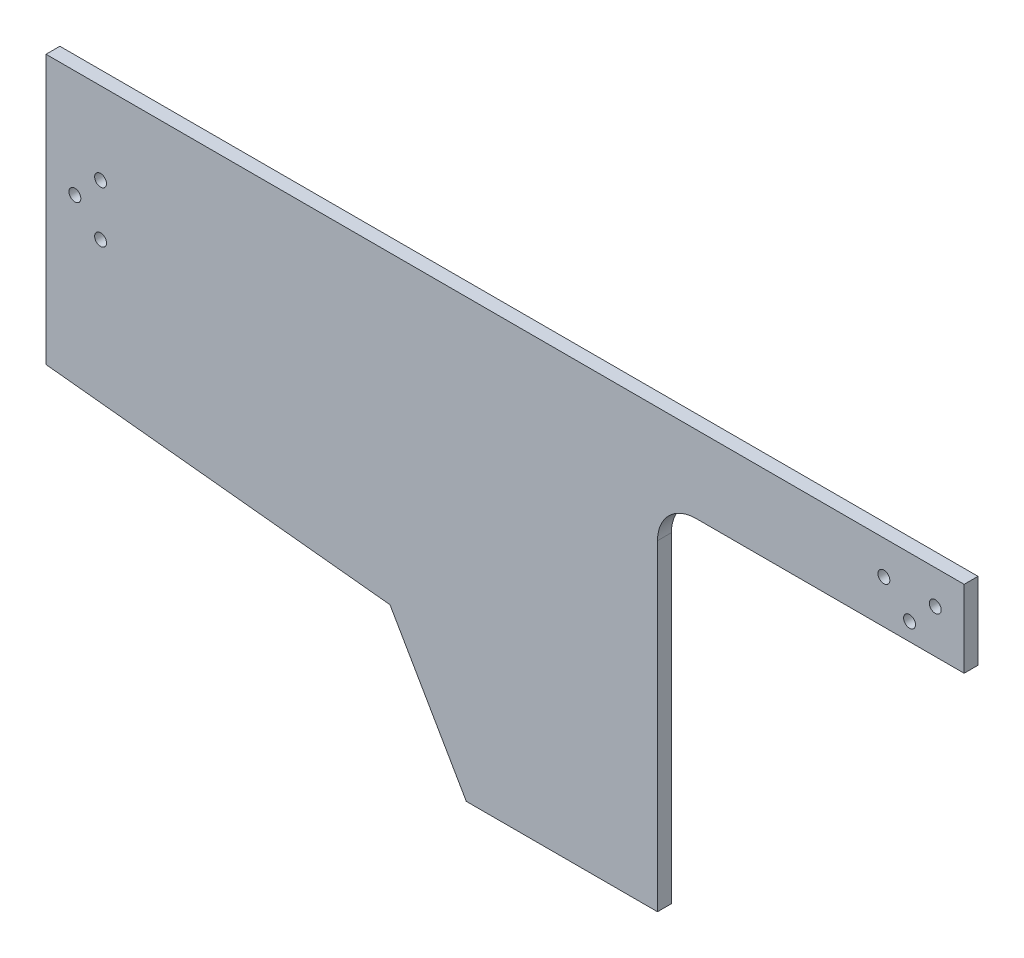
ISO-10303-21;
HEADER;
FILE_DESCRIPTION(('STEP AP214'),'2;1');
FILE_NAME('part.step','',(''),(''),'','','');
FILE_SCHEMA(('AUTOMOTIVE_DESIGN { 1 0 10303 214 1 1 1 1 }'));
ENDSEC;
DATA;
#1=APPLICATION_CONTEXT('core data for automotive mechanical design processes');
#2=APPLICATION_PROTOCOL_DEFINITION('international standard','automotive_design',2000,#1);
#3=PRODUCT_CONTEXT('',#1,'mechanical');
#4=PRODUCT('Part','Part','',(#3));
#5=PRODUCT_RELATED_PRODUCT_CATEGORY('part','',(#4));
#6=PRODUCT_DEFINITION_FORMATION('','',#4);
#7=PRODUCT_DEFINITION_CONTEXT('part definition',#1,'design');
#8=PRODUCT_DEFINITION('design','',#6,#7);
#9=PRODUCT_DEFINITION_SHAPE('','',#8);
#10=(LENGTH_UNIT() NAMED_UNIT(*) SI_UNIT(.MILLI.,.METRE.));
#11=(NAMED_UNIT(*) PLANE_ANGLE_UNIT() SI_UNIT($,.RADIAN.));
#12=(NAMED_UNIT(*) SI_UNIT($,.STERADIAN.) SOLID_ANGLE_UNIT());
#13=UNCERTAINTY_MEASURE_WITH_UNIT(LENGTH_MEASURE(1.E-05),#10,'distance_accuracy_value','');
#14=(GEOMETRIC_REPRESENTATION_CONTEXT(3) GLOBAL_UNCERTAINTY_ASSIGNED_CONTEXT((#13)) GLOBAL_UNIT_ASSIGNED_CONTEXT((#10,
#11,#12)) REPRESENTATION_CONTEXT('',''));
#15=CARTESIAN_POINT('',(0.,0.,0.));
#16=DIRECTION('',(0.,0.,1.));
#17=DIRECTION('',(1.,0.,0.));
#18=AXIS2_PLACEMENT_3D('',#15,#16,#17);
#19=CARTESIAN_POINT('',(59.48,175.,4.318));
#20=DIRECTION('',(0.,0.,-1.));
#21=DIRECTION('',(-1.,0.,0.));
#22=AXIS2_PLACEMENT_3D('',#19,#20,#21);
#23=PLANE('',#22);
#24=CARTESIAN_POINT('',(59.48,175.,4.318));
#25=DIRECTION('',(0.,0.,-1.));
#26=DIRECTION('',(-1.,0.,0.));
#27=AXIS2_PLACEMENT_3D('',#24,#25,#26);
#28=CIRCLE('',#27,12.);
#29=CARTESIAN_POINT('',(47.48,175.,4.318));
#30=VERTEX_POINT('',#29);
#31=CARTESIAN_POINT('',(59.4800000000001,187.,4.318));
#32=VERTEX_POINT('',#31);
#33=EDGE_CURVE('E153',#30,#32,#28,.T.);
#34=ORIENTED_EDGE('',*,*,#33,.T.);
#35=DIRECTION('',(1.,0.,0.));
#36=VECTOR('',#35,1.);
#37=CARTESIAN_POINT('',(59.4800000000001,187.,4.318));
#38=LINE('',#37,#36);
#39=CARTESIAN_POINT('',(143.,187.,4.318));
#40=VERTEX_POINT('',#39);
#41=EDGE_CURVE('E96',#32,#40,#38,.T.);
#42=ORIENTED_EDGE('',*,*,#41,.T.);
#43=DIRECTION('',(0.,1.,0.));
#44=VECTOR('',#43,1.);
#45=CARTESIAN_POINT('',(143.,187.,4.318));
#46=LINE('',#45,#44);
#47=CARTESIAN_POINT('',(143.,211.,4.318));
#48=VERTEX_POINT('',#47);
#49=EDGE_CURVE('E171',#40,#48,#46,.T.);
#50=ORIENTED_EDGE('',*,*,#49,.T.);
#51=DIRECTION('',(-1.,0.,0.));
#52=VECTOR('',#51,1.);
#53=CARTESIAN_POINT('',(143.,211.,4.318));
#54=LINE('',#53,#52);
#55=CARTESIAN_POINT('',(-143.,211.,4.318));
#56=VERTEX_POINT('',#55);
#57=EDGE_CURVE('E188',#48,#56,#54,.T.);
#58=ORIENTED_EDGE('',*,*,#57,.T.);
#59=DIRECTION('',(0.,-1.,0.));
#60=VECTOR('',#59,1.);
#61=CARTESIAN_POINT('',(-143.,127.288973425982,4.318));
#62=LINE('',#61,#60);
#63=CARTESIAN_POINT('',(-143.,127.288973425982,4.318));
#64=VERTEX_POINT('',#63);
#65=EDGE_CURVE('E187',#56,#64,#62,.T.);
#66=ORIENTED_EDGE('',*,*,#65,.T.);
#67=DIRECTION('',(0.994559855190001,-0.104166666666667,0.));
#68=VECTOR('',#67,1.);
#69=CARTESIAN_POINT('',(-35.8424512344837,116.06567237997,4.318));
#70=LINE('',#69,#68);
#71=CARTESIAN_POINT('',(-35.8424512344837,116.06567237997,4.318));
#72=VERTEX_POINT('',#71);
#73=EDGE_CURVE('E118',#64,#72,#70,.T.);
#74=ORIENTED_EDGE('',*,*,#73,.T.);
#75=DIRECTION('',(0.500000000000004,-0.866025403784436,0.));
#76=VECTOR('',#75,1.);
#77=CARTESIAN_POINT('',(-12.0774460348389,74.9034759320476,4.318));
#78=LINE('',#77,#76);
#79=CARTESIAN_POINT('',(-12.0774460348389,74.9034759320476,4.318));
#80=VERTEX_POINT('',#79);
#81=EDGE_CURVE('E112',#72,#80,#78,.T.);
#82=ORIENTED_EDGE('',*,*,#81,.T.);
#83=DIRECTION('',(1.,0.,0.));
#84=VECTOR('',#83,1.);
#85=CARTESIAN_POINT('',(-12.0774460348389,74.9034759320476,4.318));
#86=LINE('',#85,#84);
#87=CARTESIAN_POINT('',(47.48,74.9034759320476,4.318));
#88=VERTEX_POINT('',#87);
#89=EDGE_CURVE('E116',#80,#88,#86,.T.);
#90=ORIENTED_EDGE('',*,*,#89,.T.);
#91=DIRECTION('',(0.,1.,0.));
#92=VECTOR('',#91,1.);
#93=CARTESIAN_POINT('',(47.48,175.,4.318));
#94=LINE('',#93,#92);
#95=EDGE_CURVE('E50',#88,#30,#94,.T.);
#96=ORIENTED_EDGE('',*,*,#95,.T.);
#97=EDGE_LOOP('',(#34,#42,#50,#58,#66,#74,#82,#90,#96));
#98=FACE_BOUND('',#97,.T.);
#99=CARTESIAN_POINT('',(-134.,177.5,4.318));
#100=DIRECTION('',(0.,0.,1.));
#101=DIRECTION('',(1.,0.,0.));
#102=AXIS2_PLACEMENT_3D('',#99,#100,#101);
#103=CIRCLE('',#102,1.84999999999999);
#104=CARTESIAN_POINT('',(-132.15,177.5,4.318));
#105=VERTEX_POINT('',#104);
#106=EDGE_CURVE('E140',#105,#105,#103,.T.);
#107=ORIENTED_EDGE('',*,*,#106,.F.);
#108=EDGE_LOOP('',(#107));
#109=FACE_BOUND('',#108,.T.);
#110=CARTESIAN_POINT('',(-126.,169.5,4.318));
#111=DIRECTION('',(0.,0.,1.));
#112=DIRECTION('',(1.,0.,0.));
#113=AXIS2_PLACEMENT_3D('',#110,#111,#112);
#114=CIRCLE('',#113,1.84999999999997);
#115=CARTESIAN_POINT('',(-124.15,169.5,4.318));
#116=VERTEX_POINT('',#115);
#117=EDGE_CURVE('E198',#116,#116,#114,.T.);
#118=ORIENTED_EDGE('',*,*,#117,.F.);
#119=EDGE_LOOP('',(#118));
#120=FACE_BOUND('',#119,.T.);
#121=CARTESIAN_POINT('',(-126.,185.5,4.318));
#122=DIRECTION('',(0.,0.,1.));
#123=DIRECTION('',(1.,0.,0.));
#124=AXIS2_PLACEMENT_3D('',#121,#122,#123);
#125=CIRCLE('',#124,1.84999999999997);
#126=CARTESIAN_POINT('',(-124.15,185.5,4.318));
#127=VERTEX_POINT('',#126);
#128=EDGE_CURVE('E204',#127,#127,#125,.T.);
#129=ORIENTED_EDGE('',*,*,#128,.F.);
#130=EDGE_LOOP('',(#129));
#131=FACE_BOUND('',#130,.T.);
#132=CARTESIAN_POINT('',(118.,200.5,4.318));
#133=DIRECTION('',(0.,0.,1.));
#134=DIRECTION('',(1.,0.,0.));
#135=AXIS2_PLACEMENT_3D('',#132,#133,#134);
#136=CIRCLE('',#135,1.84999999999999);
#137=CARTESIAN_POINT('',(119.85,200.5,4.318));
#138=VERTEX_POINT('',#137);
#139=EDGE_CURVE('E210',#138,#138,#136,.T.);
#140=ORIENTED_EDGE('',*,*,#139,.F.);
#141=EDGE_LOOP('',(#140));
#142=FACE_BOUND('',#141,.T.);
#143=CARTESIAN_POINT('',(126.,192.5,4.318));
#144=DIRECTION('',(0.,0.,1.));
#145=DIRECTION('',(1.,0.,0.));
#146=AXIS2_PLACEMENT_3D('',#143,#144,#145);
#147=CIRCLE('',#146,1.85);
#148=CARTESIAN_POINT('',(127.85,192.5,4.318));
#149=VERTEX_POINT('',#148);
#150=EDGE_CURVE('E216',#149,#149,#147,.T.);
#151=ORIENTED_EDGE('',*,*,#150,.F.);
#152=EDGE_LOOP('',(#151));
#153=FACE_BOUND('',#152,.T.);
#154=CARTESIAN_POINT('',(134.,200.5,4.318));
#155=DIRECTION('',(0.,0.,1.));
#156=DIRECTION('',(1.,0.,0.));
#157=AXIS2_PLACEMENT_3D('',#154,#155,#156);
#158=CIRCLE('',#157,1.85);
#159=CARTESIAN_POINT('',(135.85,200.5,4.318));
#160=VERTEX_POINT('',#159);
#161=EDGE_CURVE('E222',#160,#160,#158,.T.);
#162=ORIENTED_EDGE('',*,*,#161,.F.);
#163=EDGE_LOOP('',(#162));
#164=FACE_BOUND('',#163,.T.);
#165=ADVANCED_FACE('F33',(#98,#109,#120,#131,#142,#153,#164),#23,.F.);
#166=CARTESIAN_POINT('',(59.48,175.,0.));
#167=DIRECTION('',(0.,0.,-1.));
#168=DIRECTION('',(-1.,0.,0.));
#169=AXIS2_PLACEMENT_3D('',#166,#167,#168);
#170=PLANE('',#169);
#171=CARTESIAN_POINT('',(126.,192.5,0.));
#172=DIRECTION('',(0.,0.,1.));
#173=DIRECTION('',(1.,0.,0.));
#174=AXIS2_PLACEMENT_3D('',#171,#172,#173);
#175=CIRCLE('',#174,1.85);
#176=CARTESIAN_POINT('',(127.85,192.5,0.));
#177=VERTEX_POINT('',#176);
#178=EDGE_CURVE('E219',#177,#177,#175,.T.);
#179=ORIENTED_EDGE('',*,*,#178,.T.);
#180=EDGE_LOOP('',(#179));
#181=FACE_BOUND('',#180,.T.);
#182=CARTESIAN_POINT('',(-126.,185.5,0.));
#183=DIRECTION('',(0.,0.,1.));
#184=DIRECTION('',(1.,0.,0.));
#185=AXIS2_PLACEMENT_3D('',#182,#183,#184);
#186=CIRCLE('',#185,1.84999999999997);
#187=CARTESIAN_POINT('',(-124.15,185.5,0.));
#188=VERTEX_POINT('',#187);
#189=EDGE_CURVE('E207',#188,#188,#186,.T.);
#190=ORIENTED_EDGE('',*,*,#189,.T.);
#191=EDGE_LOOP('',(#190));
#192=FACE_BOUND('',#191,.T.);
#193=CARTESIAN_POINT('',(-134.,177.5,0.));
#194=DIRECTION('',(0.,0.,1.));
#195=DIRECTION('',(1.,0.,0.));
#196=AXIS2_PLACEMENT_3D('',#193,#194,#195);
#197=CIRCLE('',#196,1.84999999999999);
#198=CARTESIAN_POINT('',(-132.15,177.5,0.));
#199=VERTEX_POINT('',#198);
#200=EDGE_CURVE('E195',#199,#199,#197,.T.);
#201=ORIENTED_EDGE('',*,*,#200,.T.);
#202=EDGE_LOOP('',(#201));
#203=FACE_BOUND('',#202,.T.);
#204=CARTESIAN_POINT('',(59.48,175.,0.));
#205=DIRECTION('',(0.,0.,-1.));
#206=DIRECTION('',(-1.,0.,0.));
#207=AXIS2_PLACEMENT_3D('',#204,#205,#206);
#208=CIRCLE('',#207,12.);
#209=CARTESIAN_POINT('',(47.48,175.,0.));
#210=VERTEX_POINT('',#209);
#211=CARTESIAN_POINT('',(59.4800000000001,187.,0.));
#212=VERTEX_POINT('',#211);
#213=EDGE_CURVE('E136',#210,#212,#208,.T.);
#214=ORIENTED_EDGE('',*,*,#213,.F.);
#215=DIRECTION('',(0.,1.,0.));
#216=VECTOR('',#215,1.);
#217=CARTESIAN_POINT('',(47.48,175.,0.));
#218=LINE('',#217,#216);
#219=CARTESIAN_POINT('',(47.48,74.9034759320476,0.));
#220=VERTEX_POINT('',#219);
#221=EDGE_CURVE('E88',#220,#210,#218,.T.);
#222=ORIENTED_EDGE('',*,*,#221,.F.);
#223=DIRECTION('',(1.,0.,0.));
#224=VECTOR('',#223,1.);
#225=CARTESIAN_POINT('',(-12.0774460348389,74.9034759320476,0.));
#226=LINE('',#225,#224);
#227=CARTESIAN_POINT('',(-12.0774460348389,74.9034759320476,0.));
#228=VERTEX_POINT('',#227);
#229=EDGE_CURVE('E82',#228,#220,#226,.T.);
#230=ORIENTED_EDGE('',*,*,#229,.F.);
#231=DIRECTION('',(0.500000000000004,-0.866025403784436,0.));
#232=VECTOR('',#231,1.);
#233=CARTESIAN_POINT('',(-12.0774460348389,74.9034759320476,0.));
#234=LINE('',#233,#232);
#235=CARTESIAN_POINT('',(-35.8424512344837,116.06567237997,0.));
#236=VERTEX_POINT('',#235);
#237=EDGE_CURVE('E126',#236,#228,#234,.T.);
#238=ORIENTED_EDGE('',*,*,#237,.F.);
#239=DIRECTION('',(0.994559855190001,-0.104166666666667,0.));
#240=VECTOR('',#239,1.);
#241=CARTESIAN_POINT('',(-35.8424512344837,116.06567237997,0.));
#242=LINE('',#241,#240);
#243=CARTESIAN_POINT('',(-143.,127.288973425982,0.));
#244=VERTEX_POINT('',#243);
#245=EDGE_CURVE('E148',#244,#236,#242,.T.);
#246=ORIENTED_EDGE('',*,*,#245,.F.);
#247=DIRECTION('',(0.,-1.,0.));
#248=VECTOR('',#247,1.);
#249=CARTESIAN_POINT('',(-143.,127.288973425982,0.));
#250=LINE('',#249,#248);
#251=CARTESIAN_POINT('',(-143.,211.,0.));
#252=VERTEX_POINT('',#251);
#253=EDGE_CURVE('E146',#252,#244,#250,.T.);
#254=ORIENTED_EDGE('',*,*,#253,.F.);
#255=DIRECTION('',(-1.,0.,0.));
#256=VECTOR('',#255,1.);
#257=CARTESIAN_POINT('',(143.,211.,0.));
#258=LINE('',#257,#256);
#259=CARTESIAN_POINT('',(143.,211.,0.));
#260=VERTEX_POINT('',#259);
#261=EDGE_CURVE('E144',#260,#252,#258,.T.);
#262=ORIENTED_EDGE('',*,*,#261,.F.);
#263=DIRECTION('',(0.,1.,0.));
#264=VECTOR('',#263,1.);
#265=CARTESIAN_POINT('',(143.,187.,0.));
#266=LINE('',#265,#264);
#267=CARTESIAN_POINT('',(143.,187.,0.));
#268=VERTEX_POINT('',#267);
#269=EDGE_CURVE('E142',#268,#260,#266,.T.);
#270=ORIENTED_EDGE('',*,*,#269,.F.);
#271=DIRECTION('',(1.,0.,0.));
#272=VECTOR('',#271,1.);
#273=CARTESIAN_POINT('',(59.4800000000001,187.,0.));
#274=LINE('',#273,#272);
#275=EDGE_CURVE('E139',#212,#268,#274,.T.);
#276=ORIENTED_EDGE('',*,*,#275,.F.);
#277=EDGE_LOOP('',(#214,#222,#230,#238,#246,#254,#262,#270,#276));
#278=FACE_BOUND('',#277,.T.);
#279=CARTESIAN_POINT('',(-126.,169.5,0.));
#280=DIRECTION('',(0.,0.,1.));
#281=DIRECTION('',(1.,0.,0.));
#282=AXIS2_PLACEMENT_3D('',#279,#280,#281);
#283=CIRCLE('',#282,1.84999999999997);
#284=CARTESIAN_POINT('',(-124.15,169.5,0.));
#285=VERTEX_POINT('',#284);
#286=EDGE_CURVE('E201',#285,#285,#283,.T.);
#287=ORIENTED_EDGE('',*,*,#286,.T.);
#288=EDGE_LOOP('',(#287));
#289=FACE_BOUND('',#288,.T.);
#290=CARTESIAN_POINT('',(118.,200.5,0.));
#291=DIRECTION('',(0.,0.,1.));
#292=DIRECTION('',(1.,0.,0.));
#293=AXIS2_PLACEMENT_3D('',#290,#291,#292);
#294=CIRCLE('',#293,1.84999999999999);
#295=CARTESIAN_POINT('',(119.85,200.5,0.));
#296=VERTEX_POINT('',#295);
#297=EDGE_CURVE('E213',#296,#296,#294,.T.);
#298=ORIENTED_EDGE('',*,*,#297,.T.);
#299=EDGE_LOOP('',(#298));
#300=FACE_BOUND('',#299,.T.);
#301=CARTESIAN_POINT('',(134.,200.5,0.));
#302=DIRECTION('',(0.,0.,1.));
#303=DIRECTION('',(1.,0.,0.));
#304=AXIS2_PLACEMENT_3D('',#301,#302,#303);
#305=CIRCLE('',#304,1.85);
#306=CARTESIAN_POINT('',(135.85,200.5,0.));
#307=VERTEX_POINT('',#306);
#308=EDGE_CURVE('E225',#307,#307,#305,.T.);
#309=ORIENTED_EDGE('',*,*,#308,.T.);
#310=EDGE_LOOP('',(#309));
#311=FACE_BOUND('',#310,.T.);
#312=ADVANCED_FACE('F175',(#181,#192,#203,#278,#289,#300,#311),#170,.T.);
#313=CARTESIAN_POINT('',(59.48,175.,4.318));
#314=DIRECTION('',(0.,0.,-1.));
#315=DIRECTION('',(-1.,0.,0.));
#316=AXIS2_PLACEMENT_3D('',#313,#314,#315);
#317=CYLINDRICAL_SURFACE('',#316,12.);
#318=ORIENTED_EDGE('',*,*,#213,.T.);
#319=DIRECTION('',(0.,0.,-1.));
#320=VECTOR('',#319,1.);
#321=CARTESIAN_POINT('',(59.4800000000001,187.,4.318));
#322=LINE('',#321,#320);
#323=EDGE_CURVE('E11',#32,#212,#322,.T.);
#324=ORIENTED_EDGE('',*,*,#323,.F.);
#325=ORIENTED_EDGE('',*,*,#33,.F.);
#326=DIRECTION('',(0.,0.,-1.));
#327=VECTOR('',#326,1.);
#328=CARTESIAN_POINT('',(47.48,175.,4.318));
#329=LINE('',#328,#327);
#330=EDGE_CURVE('E132',#30,#210,#329,.T.);
#331=ORIENTED_EDGE('',*,*,#330,.T.);
#332=EDGE_LOOP('',(#318,#324,#325,#331));
#333=FACE_BOUND('',#332,.T.);
#334=ADVANCED_FACE('F35',(#333),#317,.F.);
#335=CARTESIAN_POINT('',(59.4800000000001,187.,4.318));
#336=DIRECTION('',(0.,1.,0.));
#337=DIRECTION('',(-1.,0.,0.));
#338=AXIS2_PLACEMENT_3D('',#335,#336,#337);
#339=PLANE('',#338);
#340=ORIENTED_EDGE('',*,*,#275,.T.);
#341=DIRECTION('',(0.,0.,-1.));
#342=VECTOR('',#341,1.);
#343=CARTESIAN_POINT('',(143.,187.,4.318));
#344=LINE('',#343,#342);
#345=EDGE_CURVE('E42',#40,#268,#344,.T.);
#346=ORIENTED_EDGE('',*,*,#345,.F.);
#347=ORIENTED_EDGE('',*,*,#41,.F.);
#348=ORIENTED_EDGE('',*,*,#323,.T.);
#349=EDGE_LOOP('',(#340,#346,#347,#348));
#350=FACE_BOUND('',#349,.T.);
#351=ADVANCED_FACE('F261',(#350),#339,.F.);
#352=CARTESIAN_POINT('',(143.,187.,4.318));
#353=DIRECTION('',(-1.,0.,0.));
#354=DIRECTION('',(0.,0.,1.));
#355=AXIS2_PLACEMENT_3D('',#352,#353,#354);
#356=PLANE('',#355);
#357=ORIENTED_EDGE('',*,*,#269,.T.);
#358=DIRECTION('',(0.,0.,-1.));
#359=VECTOR('',#358,1.);
#360=CARTESIAN_POINT('',(143.,211.,4.318));
#361=LINE('',#360,#359);
#362=EDGE_CURVE('E163',#48,#260,#361,.T.);
#363=ORIENTED_EDGE('',*,*,#362,.F.);
#364=ORIENTED_EDGE('',*,*,#49,.F.);
#365=ORIENTED_EDGE('',*,*,#345,.T.);
#366=EDGE_LOOP('',(#357,#363,#364,#365));
#367=FACE_BOUND('',#366,.T.);
#368=ADVANCED_FACE('F169',(#367),#356,.F.);
#369=CARTESIAN_POINT('',(143.,211.,4.318));
#370=DIRECTION('',(0.,-1.,0.));
#371=DIRECTION('',(1.,0.,0.));
#372=AXIS2_PLACEMENT_3D('',#369,#370,#371);
#373=PLANE('',#372);
#374=ORIENTED_EDGE('',*,*,#261,.T.);
#375=DIRECTION('',(0.,0.,-1.));
#376=VECTOR('',#375,1.);
#377=CARTESIAN_POINT('',(-143.,211.,4.318));
#378=LINE('',#377,#376);
#379=EDGE_CURVE('E160',#56,#252,#378,.T.);
#380=ORIENTED_EDGE('',*,*,#379,.F.);
#381=ORIENTED_EDGE('',*,*,#57,.F.);
#382=ORIENTED_EDGE('',*,*,#362,.T.);
#383=EDGE_LOOP('',(#374,#380,#381,#382));
#384=FACE_BOUND('',#383,.T.);
#385=ADVANCED_FACE('F181',(#384),#373,.F.);
#386=CARTESIAN_POINT('',(-143.,127.288973425982,4.318));
#387=DIRECTION('',(1.,0.,0.));
#388=DIRECTION('',(0.,0.,-1.));
#389=AXIS2_PLACEMENT_3D('',#386,#387,#388);
#390=PLANE('',#389);
#391=ORIENTED_EDGE('',*,*,#253,.T.);
#392=DIRECTION('',(0.,0.,-1.));
#393=VECTOR('',#392,1.);
#394=CARTESIAN_POINT('',(-143.,127.288973425982,4.318));
#395=LINE('',#394,#393);
#396=EDGE_CURVE('E157',#64,#244,#395,.T.);
#397=ORIENTED_EDGE('',*,*,#396,.F.);
#398=ORIENTED_EDGE('',*,*,#65,.F.);
#399=ORIENTED_EDGE('',*,*,#379,.T.);
#400=EDGE_LOOP('',(#391,#397,#398,#399));
#401=FACE_BOUND('',#400,.T.);
#402=ADVANCED_FACE('F185',(#401),#390,.F.);
#403=CARTESIAN_POINT('',(-35.8424512344837,116.06567237997,4.318));
#404=DIRECTION('',(0.104166666666667,0.994559855190001,0.));
#405=DIRECTION('',(-0.994559855190001,0.104166666666667,0.));
#406=AXIS2_PLACEMENT_3D('',#403,#404,#405);
#407=PLANE('',#406);
#408=ORIENTED_EDGE('',*,*,#245,.T.);
#409=DIRECTION('',(0.,0.,-1.));
#410=VECTOR('',#409,1.);
#411=CARTESIAN_POINT('',(-35.8424512344837,116.06567237997,4.318));
#412=LINE('',#411,#410);
#413=EDGE_CURVE('E127',#72,#236,#412,.T.);
#414=ORIENTED_EDGE('',*,*,#413,.F.);
#415=ORIENTED_EDGE('',*,*,#73,.F.);
#416=ORIENTED_EDGE('',*,*,#396,.T.);
#417=EDGE_LOOP('',(#408,#414,#415,#416));
#418=FACE_BOUND('',#417,.T.);
#419=ADVANCED_FACE('F252',(#418),#407,.F.);
#420=CARTESIAN_POINT('',(-12.0774460348389,74.9034759320476,4.318));
#421=DIRECTION('',(0.866025403784436,0.500000000000004,0.));
#422=DIRECTION('',(-0.500000000000004,0.866025403784436,0.));
#423=AXIS2_PLACEMENT_3D('',#420,#421,#422);
#424=PLANE('',#423);
#425=ORIENTED_EDGE('',*,*,#237,.T.);
#426=DIRECTION('',(0.,0.,-1.));
#427=VECTOR('',#426,1.);
#428=CARTESIAN_POINT('',(-12.0774460348389,74.9034759320476,4.318));
#429=LINE('',#428,#427);
#430=EDGE_CURVE('E123',#80,#228,#429,.T.);
#431=ORIENTED_EDGE('',*,*,#430,.F.);
#432=ORIENTED_EDGE('',*,*,#81,.F.);
#433=ORIENTED_EDGE('',*,*,#413,.T.);
#434=EDGE_LOOP('',(#425,#431,#432,#433));
#435=FACE_BOUND('',#434,.T.);
#436=ADVANCED_FACE('F124',(#435),#424,.F.);
#437=CARTESIAN_POINT('',(-12.0774460348389,74.9034759320476,4.318));
#438=DIRECTION('',(0.,1.,0.));
#439=DIRECTION('',(0.,0.,1.));
#440=AXIS2_PLACEMENT_3D('',#437,#438,#439);
#441=PLANE('',#440);
#442=ORIENTED_EDGE('',*,*,#229,.T.);
#443=DIRECTION('',(0.,0.,-1.));
#444=VECTOR('',#443,1.);
#445=CARTESIAN_POINT('',(47.48,74.9034759320476,4.318));
#446=LINE('',#445,#444);
#447=EDGE_CURVE('E128',#88,#220,#446,.T.);
#448=ORIENTED_EDGE('',*,*,#447,.F.);
#449=ORIENTED_EDGE('',*,*,#89,.F.);
#450=ORIENTED_EDGE('',*,*,#430,.T.);
#451=EDGE_LOOP('',(#442,#448,#449,#450));
#452=FACE_BOUND('',#451,.T.);
#453=ADVANCED_FACE('F130',(#452),#441,.F.);
#454=CARTESIAN_POINT('',(47.48,175.,4.318));
#455=DIRECTION('',(-1.,0.,0.));
#456=DIRECTION('',(0.,-1.,0.));
#457=AXIS2_PLACEMENT_3D('',#454,#455,#456);
#458=PLANE('',#457);
#459=ORIENTED_EDGE('',*,*,#221,.T.);
#460=ORIENTED_EDGE('',*,*,#330,.F.);
#461=ORIENTED_EDGE('',*,*,#95,.F.);
#462=ORIENTED_EDGE('',*,*,#447,.T.);
#463=EDGE_LOOP('',(#459,#460,#461,#462));
#464=FACE_BOUND('',#463,.T.);
#465=ADVANCED_FACE('F245',(#464),#458,.F.);
#466=CARTESIAN_POINT('',(-134.,177.5,4.318));
#467=DIRECTION('',(0.,0.,-1.));
#468=DIRECTION('',(-1.,0.,0.));
#469=AXIS2_PLACEMENT_3D('',#466,#467,#468);
#470=CYLINDRICAL_SURFACE('',#469,1.84999999999999);
#471=ORIENTED_EDGE('',*,*,#106,.T.);
#472=EDGE_LOOP('',(#471));
#473=FACE_BOUND('',#472,.T.);
#474=ORIENTED_EDGE('',*,*,#200,.F.);
#475=EDGE_LOOP('',(#474));
#476=FACE_BOUND('',#475,.T.);
#477=ADVANCED_FACE('F242',(#473,#476),#470,.F.);
#478=CARTESIAN_POINT('',(-126.,169.5,4.318));
#479=DIRECTION('',(0.,0.,-1.));
#480=DIRECTION('',(-1.,0.,0.));
#481=AXIS2_PLACEMENT_3D('',#478,#479,#480);
#482=CYLINDRICAL_SURFACE('',#481,1.84999999999997);
#483=ORIENTED_EDGE('',*,*,#117,.T.);
#484=EDGE_LOOP('',(#483));
#485=FACE_BOUND('',#484,.T.);
#486=ORIENTED_EDGE('',*,*,#286,.F.);
#487=EDGE_LOOP('',(#486));
#488=FACE_BOUND('',#487,.T.);
#489=ADVANCED_FACE('F330',(#485,#488),#482,.F.);
#490=CARTESIAN_POINT('',(-126.,185.5,4.318));
#491=DIRECTION('',(0.,0.,-1.));
#492=DIRECTION('',(-1.,0.,0.));
#493=AXIS2_PLACEMENT_3D('',#490,#491,#492);
#494=CYLINDRICAL_SURFACE('',#493,1.84999999999997);
#495=ORIENTED_EDGE('',*,*,#128,.T.);
#496=EDGE_LOOP('',(#495));
#497=FACE_BOUND('',#496,.T.);
#498=ORIENTED_EDGE('',*,*,#189,.F.);
#499=EDGE_LOOP('',(#498));
#500=FACE_BOUND('',#499,.T.);
#501=ADVANCED_FACE('F338',(#497,#500),#494,.F.);
#502=CARTESIAN_POINT('',(118.,200.5,4.318));
#503=DIRECTION('',(0.,0.,-1.));
#504=DIRECTION('',(-1.,0.,0.));
#505=AXIS2_PLACEMENT_3D('',#502,#503,#504);
#506=CYLINDRICAL_SURFACE('',#505,1.84999999999999);
#507=ORIENTED_EDGE('',*,*,#139,.T.);
#508=EDGE_LOOP('',(#507));
#509=FACE_BOUND('',#508,.T.);
#510=ORIENTED_EDGE('',*,*,#297,.F.);
#511=EDGE_LOOP('',(#510));
#512=FACE_BOUND('',#511,.T.);
#513=ADVANCED_FACE('F346',(#509,#512),#506,.F.);
#514=CARTESIAN_POINT('',(126.,192.5,4.318));
#515=DIRECTION('',(0.,0.,-1.));
#516=DIRECTION('',(-1.,0.,0.));
#517=AXIS2_PLACEMENT_3D('',#514,#515,#516);
#518=CYLINDRICAL_SURFACE('',#517,1.85);
#519=ORIENTED_EDGE('',*,*,#150,.T.);
#520=EDGE_LOOP('',(#519));
#521=FACE_BOUND('',#520,.T.);
#522=ORIENTED_EDGE('',*,*,#178,.F.);
#523=EDGE_LOOP('',(#522));
#524=FACE_BOUND('',#523,.T.);
#525=ADVANCED_FACE('F355',(#521,#524),#518,.F.);
#526=CARTESIAN_POINT('',(134.,200.5,4.318));
#527=DIRECTION('',(0.,0.,-1.));
#528=DIRECTION('',(-1.,0.,0.));
#529=AXIS2_PLACEMENT_3D('',#526,#527,#528);
#530=CYLINDRICAL_SURFACE('',#529,1.85);
#531=ORIENTED_EDGE('',*,*,#161,.T.);
#532=EDGE_LOOP('',(#531));
#533=FACE_BOUND('',#532,.T.);
#534=ORIENTED_EDGE('',*,*,#308,.F.);
#535=EDGE_LOOP('',(#534));
#536=FACE_BOUND('',#535,.T.);
#537=ADVANCED_FACE('F231',(#533,#536),#530,.F.);
#538=CLOSED_SHELL('',(#165,#312,#334,#351,#368,#385,#402,#419,#436,#453,#465,#477,#489,#501,
#513,#525,#537));
#539=MANIFOLD_SOLID_BREP('B2',#538);
#540=ADVANCED_BREP_SHAPE_REPRESENTATION('',(#18,#539),#14);
#541=SHAPE_DEFINITION_REPRESENTATION(#9,#540);
ENDSEC;
END-ISO-10303-21;
